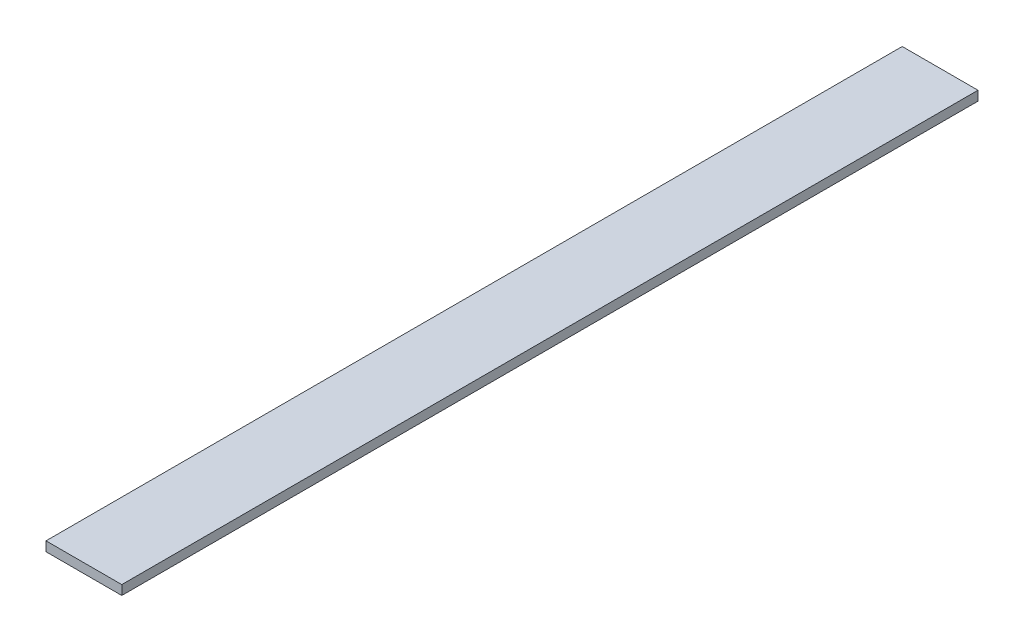
ISO-10303-21;
HEADER;
FILE_DESCRIPTION(('STEP AP214'),'2;1');
FILE_NAME('part.step','',(''),(''),'','','');
FILE_SCHEMA(('AUTOMOTIVE_DESIGN { 1 0 10303 214 1 1 1 1 }'));
ENDSEC;
DATA;
#1=APPLICATION_CONTEXT('core data for automotive mechanical design processes');
#2=APPLICATION_PROTOCOL_DEFINITION('international standard','automotive_design',2000,#1);
#3=PRODUCT_CONTEXT('',#1,'mechanical');
#4=PRODUCT('Part','Part','',(#3));
#5=PRODUCT_RELATED_PRODUCT_CATEGORY('part','',(#4));
#6=PRODUCT_DEFINITION_FORMATION('','',#4);
#7=PRODUCT_DEFINITION_CONTEXT('part definition',#1,'design');
#8=PRODUCT_DEFINITION('design','',#6,#7);
#9=PRODUCT_DEFINITION_SHAPE('','',#8);
#10=(LENGTH_UNIT() NAMED_UNIT(*) SI_UNIT(.MILLI.,.METRE.));
#11=(NAMED_UNIT(*) PLANE_ANGLE_UNIT() SI_UNIT($,.RADIAN.));
#12=(NAMED_UNIT(*) SI_UNIT($,.STERADIAN.) SOLID_ANGLE_UNIT());
#13=UNCERTAINTY_MEASURE_WITH_UNIT(LENGTH_MEASURE(1.E-05),#10,'distance_accuracy_value','');
#14=(GEOMETRIC_REPRESENTATION_CONTEXT(3) GLOBAL_UNCERTAINTY_ASSIGNED_CONTEXT((#13)) GLOBAL_UNIT_ASSIGNED_CONTEXT((#10,
#11,#12)) REPRESENTATION_CONTEXT('',''));
#15=CARTESIAN_POINT('',(0.,0.,0.));
#16=DIRECTION('',(0.,0.,1.));
#17=DIRECTION('',(1.,0.,0.));
#18=AXIS2_PLACEMENT_3D('',#15,#16,#17);
#19=CARTESIAN_POINT('',(0.,0.,452.));
#20=DIRECTION('',(1.,0.,0.));
#21=DIRECTION('',(0.,1.,0.));
#22=AXIS2_PLACEMENT_3D('',#19,#20,#21);
#23=PLANE('',#22);
#24=DIRECTION('',(0.,-1.,0.));
#25=VECTOR('',#24,1.);
#26=CARTESIAN_POINT('',(0.,0.,0.));
#27=LINE('',#26,#25);
#28=CARTESIAN_POINT('',(0.,0.,0.));
#29=VERTEX_POINT('',#28);
#30=CARTESIAN_POINT('',(0.,-5.,0.));
#31=VERTEX_POINT('',#30);
#32=EDGE_CURVE('E98',#29,#31,#27,.T.);
#33=ORIENTED_EDGE('',*,*,#32,.T.);
#34=DIRECTION('',(0.,0.,-1.));
#35=VECTOR('',#34,1.);
#36=CARTESIAN_POINT('',(0.,-5.,452.));
#37=LINE('',#36,#35);
#38=CARTESIAN_POINT('',(0.,-5.,452.));
#39=VERTEX_POINT('',#38);
#40=EDGE_CURVE('E11',#39,#31,#37,.T.);
#41=ORIENTED_EDGE('',*,*,#40,.F.);
#42=DIRECTION('',(0.,-1.,0.));
#43=VECTOR('',#42,1.);
#44=CARTESIAN_POINT('',(0.,0.,452.));
#45=LINE('',#44,#43);
#46=CARTESIAN_POINT('',(0.,0.,452.));
#47=VERTEX_POINT('',#46);
#48=EDGE_CURVE('E86',#47,#39,#45,.T.);
#49=ORIENTED_EDGE('',*,*,#48,.F.);
#50=DIRECTION('',(0.,0.,-1.));
#51=VECTOR('',#50,1.);
#52=CARTESIAN_POINT('',(0.,0.,452.));
#53=LINE('',#52,#51);
#54=EDGE_CURVE('E94',#47,#29,#53,.T.);
#55=ORIENTED_EDGE('',*,*,#54,.T.);
#56=EDGE_LOOP('',(#33,#41,#49,#55));
#57=FACE_BOUND('',#56,.T.);
#58=ADVANCED_FACE('F35',(#57),#23,.F.);
#59=CARTESIAN_POINT('',(0.,-5.,452.));
#60=DIRECTION('',(0.,1.,0.));
#61=DIRECTION('',(0.,0.,1.));
#62=AXIS2_PLACEMENT_3D('',#59,#60,#61);
#63=PLANE('',#62);
#64=DIRECTION('',(1.,0.,0.));
#65=VECTOR('',#64,1.);
#66=CARTESIAN_POINT('',(0.,-5.,0.));
#67=LINE('',#66,#65);
#68=CARTESIAN_POINT('',(40.,-5.,0.));
#69=VERTEX_POINT('',#68);
#70=EDGE_CURVE('E90',#31,#69,#67,.T.);
#71=ORIENTED_EDGE('',*,*,#70,.T.);
#72=DIRECTION('',(0.,0.,-1.));
#73=VECTOR('',#72,1.);
#74=CARTESIAN_POINT('',(40.,-5.,452.));
#75=LINE('',#74,#73);
#76=CARTESIAN_POINT('',(40.,-5.,452.));
#77=VERTEX_POINT('',#76);
#78=EDGE_CURVE('E43',#77,#69,#75,.T.);
#79=ORIENTED_EDGE('',*,*,#78,.F.);
#80=DIRECTION('',(1.,0.,0.));
#81=VECTOR('',#80,1.);
#82=CARTESIAN_POINT('',(0.,-5.,452.));
#83=LINE('',#82,#81);
#84=EDGE_CURVE('E81',#39,#77,#83,.T.);
#85=ORIENTED_EDGE('',*,*,#84,.F.);
#86=ORIENTED_EDGE('',*,*,#40,.T.);
#87=EDGE_LOOP('',(#71,#79,#85,#86));
#88=FACE_BOUND('',#87,.T.);
#89=ADVANCED_FACE('F89',(#88),#63,.F.);
#90=CARTESIAN_POINT('',(40.,0.,452.));
#91=DIRECTION('',(-1.,0.,0.));
#92=DIRECTION('',(0.,0.,1.));
#93=AXIS2_PLACEMENT_3D('',#90,#91,#92);
#94=PLANE('',#93);
#95=DIRECTION('',(0.,1.,0.));
#96=VECTOR('',#95,1.);
#97=CARTESIAN_POINT('',(40.,0.,0.));
#98=LINE('',#97,#96);
#99=CARTESIAN_POINT('',(40.,0.,0.));
#100=VERTEX_POINT('',#99);
#101=EDGE_CURVE('E68',#69,#100,#98,.T.);
#102=ORIENTED_EDGE('',*,*,#101,.T.);
#103=DIRECTION('',(0.,0.,-1.));
#104=VECTOR('',#103,1.);
#105=CARTESIAN_POINT('',(40.,0.,452.));
#106=LINE('',#105,#104);
#107=CARTESIAN_POINT('',(40.,0.,452.));
#108=VERTEX_POINT('',#107);
#109=EDGE_CURVE('E91',#108,#100,#106,.T.);
#110=ORIENTED_EDGE('',*,*,#109,.F.);
#111=DIRECTION('',(0.,1.,0.));
#112=VECTOR('',#111,1.);
#113=CARTESIAN_POINT('',(40.,0.,452.));
#114=LINE('',#113,#112);
#115=EDGE_CURVE('E84',#77,#108,#114,.T.);
#116=ORIENTED_EDGE('',*,*,#115,.F.);
#117=ORIENTED_EDGE('',*,*,#78,.T.);
#118=EDGE_LOOP('',(#102,#110,#116,#117));
#119=FACE_BOUND('',#118,.T.);
#120=ADVANCED_FACE('F92',(#119),#94,.F.);
#121=CARTESIAN_POINT('',(0.,0.,452.));
#122=DIRECTION('',(0.,-1.,0.));
#123=DIRECTION('',(1.,0.,0.));
#124=AXIS2_PLACEMENT_3D('',#121,#122,#123);
#125=PLANE('',#124);
#126=DIRECTION('',(-1.,0.,0.));
#127=VECTOR('',#126,1.);
#128=CARTESIAN_POINT('',(0.,0.,0.));
#129=LINE('',#128,#127);
#130=EDGE_CURVE('E74',#100,#29,#129,.T.);
#131=ORIENTED_EDGE('',*,*,#130,.T.);
#132=ORIENTED_EDGE('',*,*,#54,.F.);
#133=DIRECTION('',(-1.,0.,0.));
#134=VECTOR('',#133,1.);
#135=CARTESIAN_POINT('',(0.,0.,452.));
#136=LINE('',#135,#134);
#137=EDGE_CURVE('E51',#108,#47,#136,.T.);
#138=ORIENTED_EDGE('',*,*,#137,.F.);
#139=ORIENTED_EDGE('',*,*,#109,.T.);
#140=EDGE_LOOP('',(#131,#132,#138,#139));
#141=FACE_BOUND('',#140,.T.);
#142=ADVANCED_FACE('F105',(#141),#125,.F.);
#143=CARTESIAN_POINT('',(0.,0.,452.));
#144=DIRECTION('',(0.,0.,1.));
#145=DIRECTION('',(1.,0.,0.));
#146=AXIS2_PLACEMENT_3D('',#143,#144,#145);
#147=PLANE('',#146);
#148=ORIENTED_EDGE('',*,*,#48,.T.);
#149=ORIENTED_EDGE('',*,*,#84,.T.);
#150=ORIENTED_EDGE('',*,*,#115,.T.);
#151=ORIENTED_EDGE('',*,*,#137,.T.);
#152=EDGE_LOOP('',(#148,#149,#150,#151));
#153=FACE_BOUND('',#152,.T.);
#154=ADVANCED_FACE('F82',(#153),#147,.T.);
#155=CARTESIAN_POINT('',(0.,0.,0.));
#156=DIRECTION('',(0.,0.,1.));
#157=DIRECTION('',(1.,0.,0.));
#158=AXIS2_PLACEMENT_3D('',#155,#156,#157);
#159=PLANE('',#158);
#160=ORIENTED_EDGE('',*,*,#32,.F.);
#161=ORIENTED_EDGE('',*,*,#130,.F.);
#162=ORIENTED_EDGE('',*,*,#101,.F.);
#163=ORIENTED_EDGE('',*,*,#70,.F.);
#164=EDGE_LOOP('',(#160,#161,#162,#163));
#165=FACE_BOUND('',#164,.T.);
#166=ADVANCED_FACE('F108',(#165),#159,.F.);
#167=CLOSED_SHELL('',(#58,#89,#120,#142,#154,#166));
#168=MANIFOLD_SOLID_BREP('B2',#167);
#169=ADVANCED_BREP_SHAPE_REPRESENTATION('',(#18,#168),#14);
#170=SHAPE_DEFINITION_REPRESENTATION(#9,#169);
ENDSEC;
END-ISO-10303-21;
